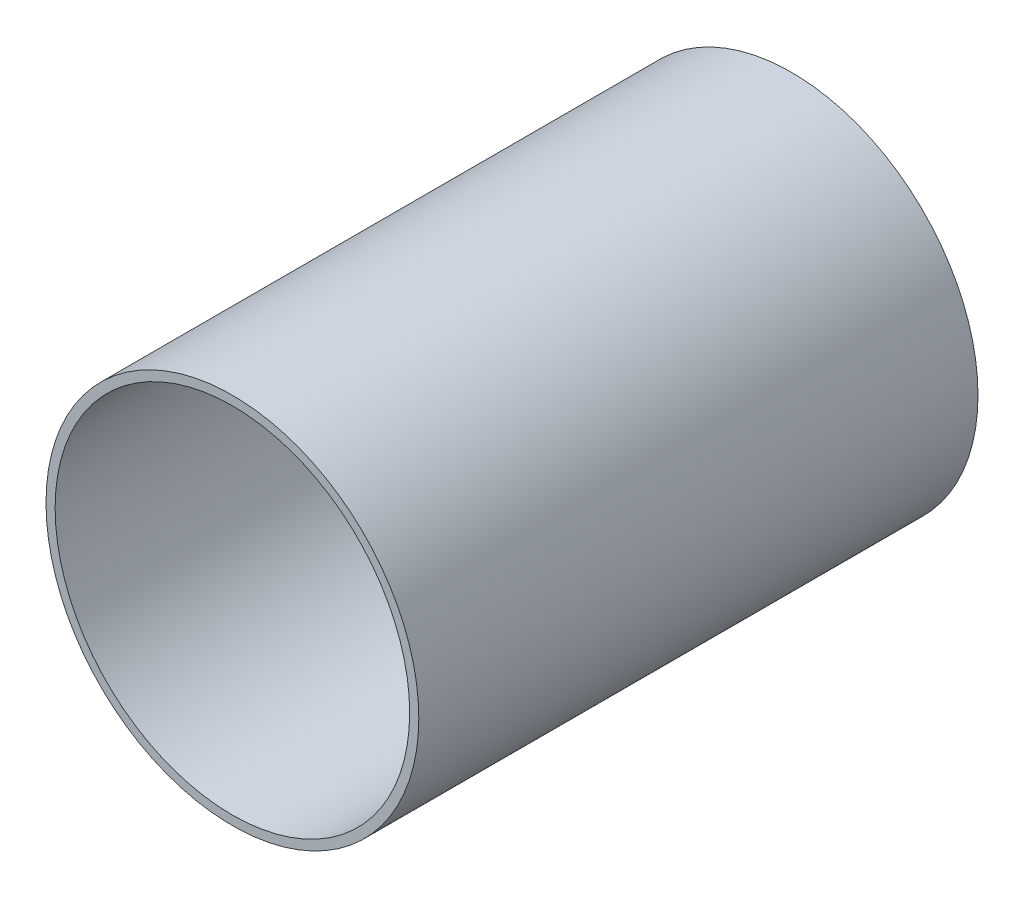
ISO-10303-21;
HEADER;
FILE_DESCRIPTION(('STEP AP214'),'2;1');
FILE_NAME('part.step','',(''),(''),'','','');
FILE_SCHEMA(('AUTOMOTIVE_DESIGN { 1 0 10303 214 1 1 1 1 }'));
ENDSEC;
DATA;
#1=APPLICATION_CONTEXT('core data for automotive mechanical design processes');
#2=APPLICATION_PROTOCOL_DEFINITION('international standard','automotive_design',2000,#1);
#3=PRODUCT_CONTEXT('',#1,'mechanical');
#4=PRODUCT('Part','Part','',(#3));
#5=PRODUCT_RELATED_PRODUCT_CATEGORY('part','',(#4));
#6=PRODUCT_DEFINITION_FORMATION('','',#4);
#7=PRODUCT_DEFINITION_CONTEXT('part definition',#1,'design');
#8=PRODUCT_DEFINITION('design','',#6,#7);
#9=PRODUCT_DEFINITION_SHAPE('','',#8);
#10=(LENGTH_UNIT() NAMED_UNIT(*) SI_UNIT(.MILLI.,.METRE.));
#11=(NAMED_UNIT(*) PLANE_ANGLE_UNIT() SI_UNIT($,.RADIAN.));
#12=(NAMED_UNIT(*) SI_UNIT($,.STERADIAN.) SOLID_ANGLE_UNIT());
#13=UNCERTAINTY_MEASURE_WITH_UNIT(LENGTH_MEASURE(1.E-05),#10,'distance_accuracy_value','');
#14=(GEOMETRIC_REPRESENTATION_CONTEXT(3) GLOBAL_UNCERTAINTY_ASSIGNED_CONTEXT((#13)) GLOBAL_UNIT_ASSIGNED_CONTEXT((#10,
#11,#12)) REPRESENTATION_CONTEXT('',''));
#15=CARTESIAN_POINT('',(0.,0.,0.));
#16=DIRECTION('',(0.,0.,1.));
#17=DIRECTION('',(1.,0.,0.));
#18=AXIS2_PLACEMENT_3D('',#15,#16,#17);
#19=CARTESIAN_POINT('',(0.,0.,76.2));
#20=DIRECTION('',(0.,0.,1.));
#21=DIRECTION('',(1.,0.,0.));
#22=AXIS2_PLACEMENT_3D('',#19,#20,#21);
#23=PLANE('',#22);
#24=CARTESIAN_POINT('',(0.,0.,76.2));
#25=DIRECTION('',(0.,0.,1.));
#26=DIRECTION('',(1.,0.,0.));
#27=AXIS2_PLACEMENT_3D('',#24,#25,#26);
#28=CIRCLE('',#27,25.4);
#29=CARTESIAN_POINT('',(25.4,0.,76.2));
#30=VERTEX_POINT('',#29);
#31=EDGE_CURVE('E10',#30,#30,#28,.T.);
#32=ORIENTED_EDGE('',*,*,#31,.T.);
#33=EDGE_LOOP('',(#32));
#34=FACE_BOUND('',#33,.T.);
#35=CARTESIAN_POINT('',(0.,0.,76.2));
#36=DIRECTION('',(0.,0.,1.));
#37=DIRECTION('',(1.,0.,0.));
#38=AXIS2_PLACEMENT_3D('',#35,#36,#37);
#39=CIRCLE('',#38,24.1554);
#40=CARTESIAN_POINT('',(24.1554,0.,76.2));
#41=VERTEX_POINT('',#40);
#42=EDGE_CURVE('E44',#41,#41,#39,.T.);
#43=ORIENTED_EDGE('',*,*,#42,.F.);
#44=EDGE_LOOP('',(#43));
#45=FACE_BOUND('',#44,.T.);
#46=ADVANCED_FACE('F33',(#34,#45),#23,.T.);
#47=CARTESIAN_POINT('',(0.,0.,0.));
#48=DIRECTION('',(0.,0.,1.));
#49=DIRECTION('',(1.,0.,0.));
#50=AXIS2_PLACEMENT_3D('',#47,#48,#49);
#51=PLANE('',#50);
#52=CARTESIAN_POINT('',(0.,0.,0.));
#53=DIRECTION('',(0.,0.,1.));
#54=DIRECTION('',(1.,0.,0.));
#55=AXIS2_PLACEMENT_3D('',#52,#53,#54);
#56=CIRCLE('',#55,25.4);
#57=CARTESIAN_POINT('',(25.4,0.,0.));
#58=VERTEX_POINT('',#57);
#59=EDGE_CURVE('E37',#58,#58,#56,.T.);
#60=ORIENTED_EDGE('',*,*,#59,.F.);
#61=EDGE_LOOP('',(#60));
#62=FACE_BOUND('',#61,.T.);
#63=CARTESIAN_POINT('',(0.,0.,0.));
#64=DIRECTION('',(0.,0.,1.));
#65=DIRECTION('',(1.,0.,0.));
#66=AXIS2_PLACEMENT_3D('',#63,#64,#65);
#67=CIRCLE('',#66,24.1554);
#68=CARTESIAN_POINT('',(24.1554,0.,0.));
#69=VERTEX_POINT('',#68);
#70=EDGE_CURVE('E46',#69,#69,#67,.T.);
#71=ORIENTED_EDGE('',*,*,#70,.T.);
#72=EDGE_LOOP('',(#71));
#73=FACE_BOUND('',#72,.T.);
#74=ADVANCED_FACE('F56',(#62,#73),#51,.F.);
#75=CARTESIAN_POINT('',(0.,0.,76.2));
#76=DIRECTION('',(0.,0.,-1.));
#77=DIRECTION('',(-1.,0.,0.));
#78=AXIS2_PLACEMENT_3D('',#75,#76,#77);
#79=CYLINDRICAL_SURFACE('',#78,25.4);
#80=ORIENTED_EDGE('',*,*,#31,.F.);
#81=EDGE_LOOP('',(#80));
#82=FACE_BOUND('',#81,.T.);
#83=ORIENTED_EDGE('',*,*,#59,.T.);
#84=EDGE_LOOP('',(#83));
#85=FACE_BOUND('',#84,.T.);
#86=ADVANCED_FACE('F35',(#82,#85),#79,.T.);
#87=CARTESIAN_POINT('',(0.,0.,76.2));
#88=DIRECTION('',(0.,0.,-1.));
#89=DIRECTION('',(-1.,0.,0.));
#90=AXIS2_PLACEMENT_3D('',#87,#88,#89);
#91=CYLINDRICAL_SURFACE('',#90,24.1554);
#92=ORIENTED_EDGE('',*,*,#42,.T.);
#93=EDGE_LOOP('',(#92));
#94=FACE_BOUND('',#93,.T.);
#95=ORIENTED_EDGE('',*,*,#70,.F.);
#96=EDGE_LOOP('',(#95));
#97=FACE_BOUND('',#96,.T.);
#98=ADVANCED_FACE('F52',(#94,#97),#91,.F.);
#99=CLOSED_SHELL('',(#46,#74,#86,#98));
#100=MANIFOLD_SOLID_BREP('B2',#99);
#101=ADVANCED_BREP_SHAPE_REPRESENTATION('',(#18,#100),#14);
#102=SHAPE_DEFINITION_REPRESENTATION(#9,#101);
ENDSEC;
END-ISO-10303-21;
